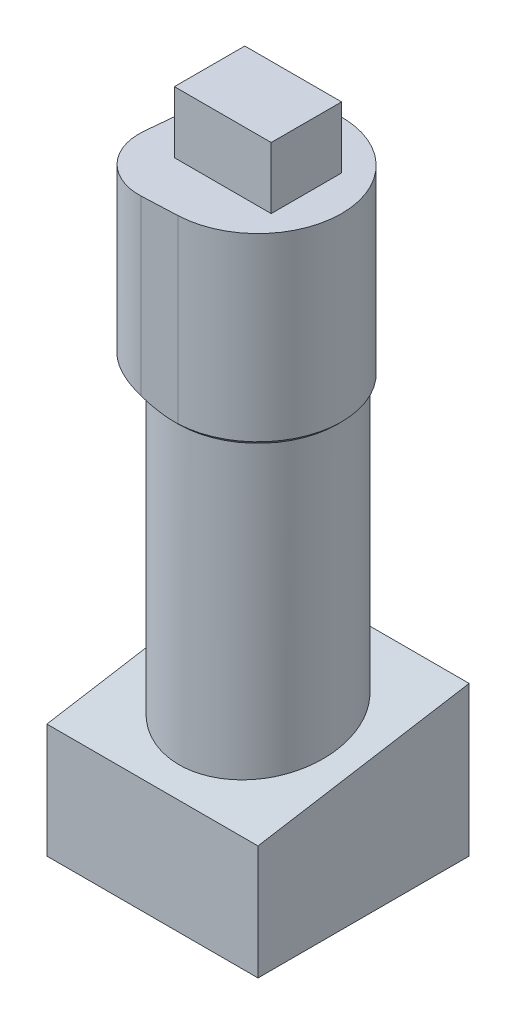
ISO-10303-21;
HEADER;
FILE_DESCRIPTION(('STEP AP214'),'2;1');
FILE_NAME('part.step','',(''),(''),'','','');
FILE_SCHEMA(('AUTOMOTIVE_DESIGN { 1 0 10303 214 1 1 1 1 }'));
ENDSEC;
DATA;
#1=APPLICATION_CONTEXT('core data for automotive mechanical design processes');
#2=APPLICATION_PROTOCOL_DEFINITION('international standard','automotive_design',2000,#1);
#3=PRODUCT_CONTEXT('',#1,'mechanical');
#4=PRODUCT('Part','Part','',(#3));
#5=PRODUCT_RELATED_PRODUCT_CATEGORY('part','',(#4));
#6=PRODUCT_DEFINITION_FORMATION('','',#4);
#7=PRODUCT_DEFINITION_CONTEXT('part definition',#1,'design');
#8=PRODUCT_DEFINITION('design','',#6,#7);
#9=PRODUCT_DEFINITION_SHAPE('','',#8);
#10=(LENGTH_UNIT() NAMED_UNIT(*) SI_UNIT(.MILLI.,.METRE.));
#11=(NAMED_UNIT(*) PLANE_ANGLE_UNIT() SI_UNIT($,.RADIAN.));
#12=(NAMED_UNIT(*) SI_UNIT($,.STERADIAN.) SOLID_ANGLE_UNIT());
#13=UNCERTAINTY_MEASURE_WITH_UNIT(LENGTH_MEASURE(1.E-05),#10,'distance_accuracy_value','');
#14=(GEOMETRIC_REPRESENTATION_CONTEXT(3) GLOBAL_UNCERTAINTY_ASSIGNED_CONTEXT((#13)) GLOBAL_UNIT_ASSIGNED_CONTEXT((#10,
#11,#12)) REPRESENTATION_CONTEXT('',''));
#15=CARTESIAN_POINT('',(0.,0.,0.));
#16=DIRECTION('',(0.,0.,1.));
#17=DIRECTION('',(1.,0.,0.));
#18=AXIS2_PLACEMENT_3D('',#15,#16,#17);
#19=CARTESIAN_POINT('',(12.,17.,12.));
#20=DIRECTION('',(-1.,0.,0.));
#21=DIRECTION('',(0.,0.,1.));
#22=AXIS2_PLACEMENT_3D('',#19,#20,#21);
#23=PLANE('',#22);
#24=DIRECTION('',(0.,-1.,0.));
#25=VECTOR('',#24,1.);
#26=CARTESIAN_POINT('',(12.,17.,-12.));
#27=LINE('',#26,#25);
#28=CARTESIAN_POINT('',(12.,17.,-12.));
#29=VERTEX_POINT('',#28);
#30=CARTESIAN_POINT('',(12.,0.,-12.));
#31=VERTEX_POINT('',#30);
#32=EDGE_CURVE('E203',#29,#31,#27,.T.);
#33=ORIENTED_EDGE('',*,*,#32,.F.);
#34=DIRECTION('',(0.,-0.164398987305357,0.986393923832144));
#35=VECTOR('',#34,1.);
#36=CARTESIAN_POINT('',(12.,17.,-12.));
#37=LINE('',#36,#35);
#38=CARTESIAN_POINT('',(12.,13.,12.));
#39=VERTEX_POINT('',#38);
#40=EDGE_CURVE('E175',#29,#39,#37,.T.);
#41=ORIENTED_EDGE('',*,*,#40,.T.);
#42=DIRECTION('',(0.,-1.,0.));
#43=VECTOR('',#42,1.);
#44=CARTESIAN_POINT('',(12.,17.,12.));
#45=LINE('',#44,#43);
#46=CARTESIAN_POINT('',(12.,0.,12.));
#47=VERTEX_POINT('',#46);
#48=EDGE_CURVE('E186',#39,#47,#45,.T.);
#49=ORIENTED_EDGE('',*,*,#48,.T.);
#50=DIRECTION('',(0.,0.,-1.));
#51=VECTOR('',#50,1.);
#52=CARTESIAN_POINT('',(12.,0.,12.));
#53=LINE('',#52,#51);
#54=EDGE_CURVE('E183',#47,#31,#53,.T.);
#55=ORIENTED_EDGE('',*,*,#54,.T.);
#56=EDGE_LOOP('',(#33,#41,#49,#55));
#57=FACE_BOUND('',#56,.T.);
#58=ADVANCED_FACE('F34',(#57),#23,.F.);
#59=CARTESIAN_POINT('',(-12.,17.,-12.));
#60=DIRECTION('',(0.,0.,1.));
#61=DIRECTION('',(1.,0.,0.));
#62=AXIS2_PLACEMENT_3D('',#59,#60,#61);
#63=PLANE('',#62);
#64=CARTESIAN_POINT('',(-5.,12.,-12.));
#65=DIRECTION('',(0.,0.,-1.));
#66=DIRECTION('',(-1.,0.,0.));
#67=AXIS2_PLACEMENT_3D('',#64,#65,#66);
#68=CIRCLE('',#67,2.05);
#69=CARTESIAN_POINT('',(-7.05,12.,-12.));
#70=VERTEX_POINT('',#69);
#71=EDGE_CURVE('E476',#70,#70,#68,.T.);
#72=ORIENTED_EDGE('',*,*,#71,.F.);
#73=EDGE_LOOP('',(#72));
#74=FACE_BOUND('',#73,.T.);
#75=CARTESIAN_POINT('',(5.,12.,-12.));
#76=DIRECTION('',(0.,0.,-1.));
#77=DIRECTION('',(-1.,0.,0.));
#78=AXIS2_PLACEMENT_3D('',#75,#76,#77);
#79=CIRCLE('',#78,2.05);
#80=CARTESIAN_POINT('',(2.95,12.,-12.));
#81=VERTEX_POINT('',#80);
#82=EDGE_CURVE('E479',#81,#81,#79,.T.);
#83=ORIENTED_EDGE('',*,*,#82,.F.);
#84=EDGE_LOOP('',(#83));
#85=FACE_BOUND('',#84,.T.);
#86=DIRECTION('',(-1.,0.,0.));
#87=VECTOR('',#86,1.);
#88=CARTESIAN_POINT('',(-12.,0.,-12.));
#89=LINE('',#88,#87);
#90=CARTESIAN_POINT('',(-12.,0.,-12.));
#91=VERTEX_POINT('',#90);
#92=EDGE_CURVE('E190',#31,#91,#89,.T.);
#93=ORIENTED_EDGE('',*,*,#92,.T.);
#94=DIRECTION('',(0.,-1.,0.));
#95=VECTOR('',#94,1.);
#96=CARTESIAN_POINT('',(-12.,17.,-12.));
#97=LINE('',#96,#95);
#98=CARTESIAN_POINT('',(-12.,17.,-12.));
#99=VERTEX_POINT('',#98);
#100=EDGE_CURVE('E200',#99,#91,#97,.T.);
#101=ORIENTED_EDGE('',*,*,#100,.F.);
#102=DIRECTION('',(-1.,0.,0.));
#103=VECTOR('',#102,1.);
#104=CARTESIAN_POINT('',(-12.,17.,-12.));
#105=LINE('',#104,#103);
#106=EDGE_CURVE('E184',#29,#99,#105,.T.);
#107=ORIENTED_EDGE('',*,*,#106,.F.);
#108=ORIENTED_EDGE('',*,*,#32,.T.);
#109=EDGE_LOOP('',(#93,#101,#107,#108));
#110=FACE_BOUND('',#109,.T.);
#111=ADVANCED_FACE('F288',(#74,#85,#110),#63,.F.);
#112=CARTESIAN_POINT('',(-12.,17.,12.));
#113=DIRECTION('',(1.,0.,0.));
#114=DIRECTION('',(0.,0.,-1.));
#115=AXIS2_PLACEMENT_3D('',#112,#113,#114);
#116=PLANE('',#115);
#117=DIRECTION('',(0.,-1.,0.));
#118=VECTOR('',#117,1.);
#119=CARTESIAN_POINT('',(-12.,17.,12.));
#120=LINE('',#119,#118);
#121=CARTESIAN_POINT('',(-12.,13.,12.));
#122=VERTEX_POINT('',#121);
#123=CARTESIAN_POINT('',(-12.,0.,12.));
#124=VERTEX_POINT('',#123);
#125=EDGE_CURVE('E198',#122,#124,#120,.T.);
#126=ORIENTED_EDGE('',*,*,#125,.F.);
#127=DIRECTION('',(0.,-0.164398987305357,0.986393923832144));
#128=VECTOR('',#127,1.);
#129=CARTESIAN_POINT('',(-12.,17.,-12.));
#130=LINE('',#129,#128);
#131=EDGE_CURVE('E179',#99,#122,#130,.T.);
#132=ORIENTED_EDGE('',*,*,#131,.F.);
#133=ORIENTED_EDGE('',*,*,#100,.T.);
#134=DIRECTION('',(0.,0.,1.));
#135=VECTOR('',#134,1.);
#136=CARTESIAN_POINT('',(-12.,0.,12.));
#137=LINE('',#136,#135);
#138=EDGE_CURVE('E192',#91,#124,#137,.T.);
#139=ORIENTED_EDGE('',*,*,#138,.T.);
#140=EDGE_LOOP('',(#126,#132,#133,#139));
#141=FACE_BOUND('',#140,.T.);
#142=ADVANCED_FACE('F293',(#141),#116,.F.);
#143=CARTESIAN_POINT('',(-12.,17.,12.));
#144=DIRECTION('',(0.,0.,-1.));
#145=DIRECTION('',(-1.,0.,0.));
#146=AXIS2_PLACEMENT_3D('',#143,#144,#145);
#147=PLANE('',#146);
#148=ORIENTED_EDGE('',*,*,#48,.F.);
#149=DIRECTION('',(-1.,0.,0.));
#150=VECTOR('',#149,1.);
#151=CARTESIAN_POINT('',(12.,13.,12.));
#152=LINE('',#151,#150);
#153=EDGE_CURVE('E178',#39,#122,#152,.T.);
#154=ORIENTED_EDGE('',*,*,#153,.T.);
#155=ORIENTED_EDGE('',*,*,#125,.T.);
#156=DIRECTION('',(1.,0.,0.));
#157=VECTOR('',#156,1.);
#158=CARTESIAN_POINT('',(-12.,0.,12.));
#159=LINE('',#158,#157);
#160=EDGE_CURVE('E187',#124,#47,#159,.T.);
#161=ORIENTED_EDGE('',*,*,#160,.T.);
#162=EDGE_LOOP('',(#148,#154,#155,#161));
#163=FACE_BOUND('',#162,.T.);
#164=ADVANCED_FACE('F300',(#163),#147,.F.);
#165=CARTESIAN_POINT('',(0.,0.,0.));
#166=DIRECTION('',(0.,-1.,0.));
#167=DIRECTION('',(0.,0.,-1.));
#168=AXIS2_PLACEMENT_3D('',#165,#166,#167);
#169=PLANE('',#168);
#170=ORIENTED_EDGE('',*,*,#54,.F.);
#171=ORIENTED_EDGE('',*,*,#160,.F.);
#172=ORIENTED_EDGE('',*,*,#138,.F.);
#173=ORIENTED_EDGE('',*,*,#92,.F.);
#174=EDGE_LOOP('',(#170,#171,#172,#173));
#175=FACE_BOUND('',#174,.T.);
#176=ADVANCED_FACE('F304',(#175),#169,.T.);
#177=CARTESIAN_POINT('',(12.,17.,-12.));
#178=DIRECTION('',(0.,-0.986393923832144,-0.164398987305357));
#179=DIRECTION('',(0.,0.164398987305357,-0.986393923832144));
#180=AXIS2_PLACEMENT_3D('',#177,#178,#179);
#181=PLANE('',#180);
#182=CARTESIAN_POINT('',(0.,15.,0.));
#183=DIRECTION('',(0.,-0.986393923832144,-0.164398987305357));
#184=DIRECTION('',(0.,-0.164398987305357,0.986393923832144));
#185=AXIS2_PLACEMENT_3D('',#182,#183,#184);
#186=ELLIPSE('',#185,9.12414379544733,9.);
#187=CARTESIAN_POINT('',(0.,13.5,9.));
#188=VERTEX_POINT('',#187);
#189=EDGE_CURVE('E174',#188,#188,#186,.T.);
#190=ORIENTED_EDGE('',*,*,#189,.T.);
#191=EDGE_LOOP('',(#190));
#192=FACE_BOUND('',#191,.T.);
#193=ORIENTED_EDGE('',*,*,#131,.T.);
#194=ORIENTED_EDGE('',*,*,#153,.F.);
#195=ORIENTED_EDGE('',*,*,#40,.F.);
#196=ORIENTED_EDGE('',*,*,#106,.T.);
#197=EDGE_LOOP('',(#193,#194,#195,#196));
#198=FACE_BOUND('',#197,.T.);
#199=ADVANCED_FACE('F307',(#192,#198),#181,.F.);
#200=CARTESIAN_POINT('',(0.,52.,0.));
#201=DIRECTION('',(0.,-1.,0.));
#202=DIRECTION('',(0.,0.,-1.));
#203=AXIS2_PLACEMENT_3D('',#200,#201,#202);
#204=CYLINDRICAL_SURFACE('',#203,9.);
#205=CARTESIAN_POINT('',(0.,46.9999999999999,0.));
#206=DIRECTION('',(0.,1.,0.));
#207=DIRECTION('',(0.,0.,1.));
#208=AXIS2_PLACEMENT_3D('',#205,#206,#207);
#209=CIRCLE('',#208,9.);
#210=CARTESIAN_POINT('',(0.,46.9999999999999,9.));
#211=VERTEX_POINT('',#210);
#212=EDGE_CURVE('E206',#211,#211,#209,.F.);
#213=ORIENTED_EDGE('',*,*,#212,.T.);
#214=EDGE_LOOP('',(#213));
#215=FACE_BOUND('',#214,.T.);
#216=ORIENTED_EDGE('',*,*,#189,.F.);
#217=EDGE_LOOP('',(#216));
#218=FACE_BOUND('',#217,.T.);
#219=ADVANCED_FACE('F233',(#215,#218),#204,.T.);
#220=CARTESIAN_POINT('',(-3.86826162983517,68.,3.6707021280932));
#221=DIRECTION('',(0.,-1.,0.));
#222=DIRECTION('',(0.,0.,-1.));
#223=AXIS2_PLACEMENT_3D('',#220,#221,#222);
#224=CYLINDRICAL_SURFACE('',#223,6.);
#225=DIRECTION('',(0.,-1.,0.));
#226=VECTOR('',#225,1.);
#227=CARTESIAN_POINT('',(-9.84083401998827,68.,3.09765846101286));
#228=LINE('',#227,#226);
#229=CARTESIAN_POINT('',(-9.84083401998827,68.,3.09765846101286));
#230=VERTEX_POINT('',#229);
#231=CARTESIAN_POINT('',(-9.84083401998827,48.3168552451821,3.09765846101286));
#232=VERTEX_POINT('',#231);
#233=EDGE_CURVE('E166',#230,#232,#228,.T.);
#234=ORIENTED_EDGE('',*,*,#233,.T.);
#235=CARTESIAN_POINT('',(-9.84083401998827,48.3168552451821,3.09765846101286));
#236=CARTESIAN_POINT('',(-9.85573754474704,48.3776440578477,3.25280616041078));
#237=CARTESIAN_POINT('',(-9.86464730566725,48.436178111364,3.40944212347759));
#238=CARTESIAN_POINT('',(-9.87008583844924,48.5484736473786,3.72469532544573));
#239=CARTESIAN_POINT('',(-9.86660958426917,48.602233183385,3.88331334261025));
#240=CARTESIAN_POINT('',(-9.84684585274468,48.7047915414958,4.20179503951704));
#241=CARTESIAN_POINT('',(-9.83052720027604,48.7535779653433,4.36166081198082));
#242=CARTESIAN_POINT('',(-9.78478105392862,48.8457521005011,4.68105677672731));
#243=CARTESIAN_POINT('',(-9.75535535342605,48.8891405493524,4.84058701192074));
#244=CARTESIAN_POINT('',(-9.68315170878094,48.9703749443236,5.15855600198107));
#245=CARTESIAN_POINT('',(-9.64033526306552,49.0082044401845,5.316990245692));
#246=CARTESIAN_POINT('',(-9.54138953614979,49.0779167848524,5.63098602827183));
#247=CARTESIAN_POINT('',(-9.48526073070653,49.1097998461002,5.78654766958768));
#248=CARTESIAN_POINT('',(-9.35994992038933,49.1673563288671,6.09325547745622));
#249=CARTESIAN_POINT('',(-9.29078600899688,49.1930382465376,6.24440743301604));
#250=CARTESIAN_POINT('',(-9.13970284784554,49.2380583275038,6.54117718453411));
#251=CARTESIAN_POINT('',(-9.05778445896232,49.257396918675,6.68679535317595));
#252=CARTESIAN_POINT('',(-8.88660149788428,49.2886913296795,6.96330327803644));
#253=CARTESIAN_POINT('',(-8.79799611022533,49.3009970522908,7.09456199528907));
#254=CARTESIAN_POINT('',(-8.61045793769266,49.3197327494017,7.34992291844453));
#255=CARTESIAN_POINT('',(-8.51152563141967,49.3261629960655,7.47402545558686));
#256=CARTESIAN_POINT('',(-8.30402165749475,49.3331032112673,7.71411842149772));
#257=CARTESIAN_POINT('',(-8.19544778514609,49.3336118221987,7.83010698398133));
#258=CARTESIAN_POINT('',(-7.96951204101418,49.328701571032,8.05304516386679));
#259=CARTESIAN_POINT('',(-7.85215032577429,49.3232828144985,8.15999494220997));
#260=CARTESIAN_POINT('',(-7.61396763812992,49.3068601938132,8.3603743115635));
#261=CARTESIAN_POINT('',(-7.4934257036712,49.2960656201865,8.45415319047075));
#262=CARTESIAN_POINT('',(-7.2459116939912,49.2690736094618,8.63202372343476));
#263=CARTESIAN_POINT('',(-7.1189376187236,49.252874482986,8.71611233739647));
#264=CARTESIAN_POINT('',(-6.85958715346042,49.2151830505001,8.87406829058441));
#265=CARTESIAN_POINT('',(-6.72721223781714,49.1936921811003,8.94793839546024));
#266=CARTESIAN_POINT('',(-6.45800864431225,49.145547420143,9.08513056829842));
#267=CARTESIAN_POINT('',(-6.3211797820613,49.1188933146056,9.14845219889794));
#268=CARTESIAN_POINT('',(-6.04184509332307,49.060112967494,9.26523676308325));
#269=CARTESIAN_POINT('',(-5.89928340639167,49.0279057907856,9.31852522098738));
#270=CARTESIAN_POINT('',(-5.61167542340985,48.9585240061154,9.41382439227958));
#271=CARTESIAN_POINT('',(-5.4666298308898,48.9213507850716,9.45583824462063));
#272=CARTESIAN_POINT('',(-5.17503464619293,48.8422375693034,9.52859630935772));
#273=CARTESIAN_POINT('',(-5.02848512105144,48.8002977862085,9.55934102183362));
#274=CARTESIAN_POINT('',(-4.73488931269597,48.7118802410956,9.609652774014));
#275=CARTESIAN_POINT('',(-4.58784318401978,48.665403784124,9.62922301720097));
#276=CARTESIAN_POINT('',(-4.30128424339746,48.5704953156699,9.65670113890683));
#277=CARTESIAN_POINT('',(-4.16175274768609,48.5222682329774,9.66512975503689));
#278=CARTESIAN_POINT('',(-3.88411968640995,48.4222233886129,9.67228646588472));
#279=CARTESIAN_POINT('',(-3.74601543750733,48.3704148040016,9.67103850441741));
#280=CARTESIAN_POINT('',(-3.60881367641573,48.3168552451821,9.6650900667794));
#281=B_SPLINE_CURVE_WITH_KNOTS('',3,(#235,#236,#237,#238,#239,#240,#241,#242,#243,#244,#245,
#246,#247,#248,#249,#250,#251,#252,#253,#254,#255,#256,#257,#258,#259,#260,#261,#262,#263,#264,
#265,#266,#267,#268,#269,#270,#271,#272,#273,#274,#275,#276,#277,#278,#279,#280),.UNSPECIFIED.,
.F.,.F.,(4,2,2,2,2,2,2,2,2,2,2,2,2,2,2,2,2,2,2,2,2,2,4),(0.,0.501802618237004,1.00380888293515,
1.50703754886879,2.0101973815125,2.51481742878223,3.01941944466,3.52332613460137,
4.02719882761027,4.50313288390196,4.97904489282873,5.45506600818417,5.93107864589307,
6.38985893536135,6.84878276686603,7.30758214614069,7.76640054350992,8.23258034401857,
8.69863022085125,9.16465941372922,9.63055493879385,10.0737997870465,10.5159482167062),.UNSPECIFIED.);
#282=CARTESIAN_POINT('',(-3.60881367641573,48.3168552451821,9.6650900667794));
#283=VERTEX_POINT('',#282);
#284=EDGE_CURVE('E49',#232,#283,#281,.T.);
#285=ORIENTED_EDGE('',*,*,#284,.T.);
#286=DIRECTION('',(0.,-1.,0.));
#287=VECTOR('',#286,1.);
#288=CARTESIAN_POINT('',(-3.60881367641573,68.,9.6650900667794));
#289=LINE('',#288,#287);
#290=CARTESIAN_POINT('',(-3.60881367641573,68.,9.6650900667794));
#291=VERTEX_POINT('',#290);
#292=EDGE_CURVE('E172',#291,#283,#289,.T.);
#293=ORIENTED_EDGE('',*,*,#292,.F.);
#294=CARTESIAN_POINT('',(-3.86826162983517,68.,3.6707021280932));
#295=DIRECTION('',(0.,1.,0.));
#296=DIRECTION('',(0.,0.,1.));
#297=AXIS2_PLACEMENT_3D('',#294,#295,#296);
#298=CIRCLE('',#297,6.);
#299=EDGE_CURVE('E152',#230,#291,#298,.T.);
#300=ORIENTED_EDGE('',*,*,#299,.F.);
#301=EDGE_LOOP('',(#234,#285,#293,#300));
#302=FACE_BOUND('',#301,.T.);
#303=ADVANCED_FACE('F226',(#302),#224,.T.);
#304=CARTESIAN_POINT('',(-3.60881367641573,68.,9.6650900667794));
#305=DIRECTION('',(-0.0432413255699056,0.,-0.999064656447698));
#306=DIRECTION('',(-0.999064656447698,0.,0.0432413255699056));
#307=AXIS2_PLACEMENT_3D('',#304,#305,#306);
#308=PLANE('',#307);
#309=ORIENTED_EDGE('',*,*,#292,.T.);
#310=CARTESIAN_POINT('',(-3.60881367641573,48.3168552451821,9.6650900667794));
#311=CARTESIAN_POINT('',(-3.4485766210115,48.2543090111599,9.65815471716375));
#312=CARTESIAN_POINT('',(-3.28724732144487,48.1945047615118,9.65117209324496));
#313=CARTESIAN_POINT('',(-2.96273052913715,48.0811131728394,9.63712641944546));
#314=CARTESIAN_POINT('',(-2.79954661410567,48.0275155566698,9.63006352441448));
#315=CARTESIAN_POINT('',(-2.47108014378419,47.9270471933909,9.61584690140585));
#316=CARTESIAN_POINT('',(-2.30579723665992,47.8801775906767,9.60869315820017));
#317=CARTESIAN_POINT('',(-1.97304371465778,47.7937411755076,9.59429098383981));
#318=CARTESIAN_POINT('',(-1.80556988585717,47.7541867871958,9.58704241358075));
#319=CARTESIAN_POINT('',(-1.63722106527422,47.7186530600417,9.57975597209455));
#320=B_SPLINE_CURVE_WITH_KNOTS('',3,(#310,#311,#312,#313,#314,#315,#316,#317,#318,#319),
.UNSPECIFIED.,.F.,.F.,(4,2,2,2,4),(0.,0.516460874359341,1.03205396335808,1.54773464802627,
2.06428327785127),.UNSPECIFIED.);
#321=CARTESIAN_POINT('',(-1.63722106527422,47.7186530600417,9.57975597209455));
#322=VERTEX_POINT('',#321);
#323=EDGE_CURVE('E11',#283,#322,#320,.T.);
#324=ORIENTED_EDGE('',*,*,#323,.T.);
#325=CARTESIAN_POINT('',(-1.63722106527422,47.7186530600417,9.57975597209455));
#326=CARTESIAN_POINT('',(-1.46877277749134,47.6830686239895,9.57246522548801));
#327=CARTESIAN_POINT('',(-1.29944824053798,47.6515330946803,9.56513655323229));
#328=CARTESIAN_POINT('',(-0.959894777084272,47.5971006116259,9.55044006510529));
#329=CARTESIAN_POINT('',(-0.789669563811105,47.5741803916843,9.54307240994919));
#330=CARTESIAN_POINT('',(-0.448223675051389,47.5373186850589,9.52829401423168));
#331=CARTESIAN_POINT('',(-0.277002893562176,47.5233781728276,9.52088326908228));
#332=CARTESIAN_POINT('',(0.0664052877205288,47.5046904651637,9.50601994179472));
#333=CARTESIAN_POINT('',(0.238594050205988,47.4999684470195,9.49856730067679));
#334=CARTESIAN_POINT('',(0.410792592914101,47.4999999999999,9.49111423625313));
#335=B_SPLINE_CURVE_WITH_KNOTS('',3,(#325,#326,#327,#328,#329,#330,#331,#332,#333,#334),
.UNSPECIFIED.,.F.,.F.,(4,2,2,2,4),(0.,0.516943582172929,1.03248092008697,1.54807419323473,
2.06507368083808),.UNSPECIFIED.);
#336=CARTESIAN_POINT('',(0.4107925929141,47.4999999999999,9.49111423625313));
#337=VERTEX_POINT('',#336);
#338=EDGE_CURVE('E211',#322,#337,#335,.T.);
#339=ORIENTED_EDGE('',*,*,#338,.T.);
#340=DIRECTION('',(0.,-1.,0.));
#341=VECTOR('',#340,1.);
#342=CARTESIAN_POINT('',(0.4107925929141,68.,9.49111423625313));
#343=LINE('',#342,#341);
#344=CARTESIAN_POINT('',(0.4107925929141,68.,9.49111423625313));
#345=VERTEX_POINT('',#344);
#346=EDGE_CURVE('E170',#345,#337,#343,.T.);
#347=ORIENTED_EDGE('',*,*,#346,.F.);
#348=DIRECTION('',(0.999064656447698,0.,-0.0432413255699056));
#349=VECTOR('',#348,1.);
#350=CARTESIAN_POINT('',(-3.60881367641573,68.,9.6650900667794));
#351=LINE('',#350,#349);
#352=EDGE_CURVE('E155',#291,#345,#351,.T.);
#353=ORIENTED_EDGE('',*,*,#352,.F.);
#354=EDGE_LOOP('',(#309,#324,#339,#347,#353));
#355=FACE_BOUND('',#354,.T.);
#356=ADVANCED_FACE('F220',(#355),#308,.F.);
#357=CARTESIAN_POINT('',(0.,68.,0.));
#358=DIRECTION('',(0.,-1.,0.));
#359=DIRECTION('',(0.,0.,-1.));
#360=AXIS2_PLACEMENT_3D('',#357,#358,#359);
#361=CYLINDRICAL_SURFACE('',#360,9.5);
#362=ORIENTED_EDGE('',*,*,#346,.T.);
#363=CARTESIAN_POINT('',(0.,47.4999999999999,0.));
#364=DIRECTION('',(0.,1.,0.));
#365=DIRECTION('',(0.,0.,1.));
#366=AXIS2_PLACEMENT_3D('',#363,#364,#365);
#367=CIRCLE('',#366,9.5);
#368=CARTESIAN_POINT('',(-9.45657295107574,47.4999999999999,-0.907319139543884));
#369=VERTEX_POINT('',#368);
#370=EDGE_CURVE('E218',#337,#369,#367,.T.);
#371=ORIENTED_EDGE('',*,*,#370,.T.);
#372=DIRECTION('',(0.,-1.,0.));
#373=VECTOR('',#372,1.);
#374=CARTESIAN_POINT('',(-9.45657295107574,68.,-0.907319139543884));
#375=LINE('',#374,#373);
#376=CARTESIAN_POINT('',(-9.45657295107574,68.,-0.907319139543884));
#377=VERTEX_POINT('',#376);
#378=EDGE_CURVE('E168',#377,#369,#375,.T.);
#379=ORIENTED_EDGE('',*,*,#378,.F.);
#380=CARTESIAN_POINT('',(0.,68.,0.));
#381=DIRECTION('',(0.,1.,0.));
#382=DIRECTION('',(0.,0.,1.));
#383=AXIS2_PLACEMENT_3D('',#380,#381,#382);
#384=CIRCLE('',#383,9.5);
#385=EDGE_CURVE('E162',#345,#377,#384,.T.);
#386=ORIENTED_EDGE('',*,*,#385,.F.);
#387=EDGE_LOOP('',(#362,#371,#379,#386));
#388=FACE_BOUND('',#387,.T.);
#389=ADVANCED_FACE('F225',(#388),#361,.T.);
#390=CARTESIAN_POINT('',(-9.45657295107574,68.,-0.907319139543884));
#391=DIRECTION('',(0.995428731692183,0.,0.0955072778467242));
#392=DIRECTION('',(0.0955072778467242,0.,-0.995428731692183));
#393=AXIS2_PLACEMENT_3D('',#390,#391,#392);
#394=PLANE('',#393);
#395=ORIENTED_EDGE('',*,*,#378,.T.);
#396=CARTESIAN_POINT('',(-9.45657295107574,47.4999999999999,-0.907319139543884));
#397=CARTESIAN_POINT('',(-9.47048770563757,47.4999831475193,-0.762292008653158));
#398=CARTESIAN_POINT('',(-9.48440191357004,47.5033511023661,-0.617270575030638));
#399=CARTESIAN_POINT('',(-9.51219908493016,47.5167314875751,-0.327553354987602));
#400=CARTESIAN_POINT('',(-9.52608205284939,47.5267428921619,-0.182857521753334));
#401=CARTESIAN_POINT('',(-9.55377139618719,47.5532664206997,0.105735856066162));
#402=CARTESIAN_POINT('',(-9.56757785193361,47.569769370379,0.249634237872025));
#403=CARTESIAN_POINT('',(-9.59510867305702,47.6090387382205,0.536575411059955));
#404=CARTESIAN_POINT('',(-9.60883303632164,47.6318053168542,0.679618180425662));
#405=CARTESIAN_POINT('',(-9.64950258619469,47.7084184954215,1.10349832193274));
#406=CARTESIAN_POINT('',(-9.6763017829475,47.7709358872637,1.38281410849334));
#407=CARTESIAN_POINT('',(-9.72937848972814,47.9164968943924,1.93600837917332));
#408=CARTESIAN_POINT('',(-9.75565600038717,47.999540484842,2.20988686987143));
#409=CARTESIAN_POINT('',(-9.7915814781609,48.1264105327673,2.58432171485919));
#410=CARTESIAN_POINT('',(-9.80147551274591,48.1627769350919,2.68744271799448));
#411=CARTESIAN_POINT('',(-9.82120497822794,48.2380013740438,2.89307392479385));
#412=CARTESIAN_POINT('',(-9.8310401998457,48.2768654323746,2.99558194723573));
#413=CARTESIAN_POINT('',(-9.84083401998827,48.3168552451821,3.09765846101286));
#414=B_SPLINE_CURVE_WITH_KNOTS('',3,(#396,#397,#398,#399,#400,#401,#402,#403,#404,#405,#406,
#407,#408,#409,#410,#411,#412,#413),.UNSPECIFIED.,.F.,.F.,(4,2,2,2,2,2,2,2,4),(0.,
0.437030996981679,0.873994530315787,1.31034272451418,1.74670209880244,2.60817550314992,
3.46964786511195,3.79900338882883,4.12918514039466),.UNSPECIFIED.);
#415=EDGE_CURVE('E241',#369,#232,#414,.T.);
#416=ORIENTED_EDGE('',*,*,#415,.T.);
#417=ORIENTED_EDGE('',*,*,#233,.F.);
#418=DIRECTION('',(-0.0955072778467242,0.,0.995428731692183));
#419=VECTOR('',#418,1.);
#420=CARTESIAN_POINT('',(-9.45657295107574,68.,-0.907319139543884));
#421=LINE('',#420,#419);
#422=EDGE_CURVE('E164',#377,#230,#421,.T.);
#423=ORIENTED_EDGE('',*,*,#422,.F.);
#424=EDGE_LOOP('',(#395,#416,#417,#423));
#425=FACE_BOUND('',#424,.T.);
#426=ADVANCED_FACE('F247',(#425),#394,.F.);
#427=CARTESIAN_POINT('',(-3.86826162983517,68.,3.6707021280932));
#428=DIRECTION('',(0.,1.,0.));
#429=DIRECTION('',(0.,0.,1.));
#430=AXIS2_PLACEMENT_3D('',#427,#428,#429);
#431=PLANE('',#430);
#432=DIRECTION('',(0.,0.,-1.));
#433=VECTOR('',#432,1.);
#434=CARTESIAN_POINT('',(5.5,68.,4.));
#435=LINE('',#434,#433);
#436=CARTESIAN_POINT('',(5.5,68.,4.));
#437=VERTEX_POINT('',#436);
#438=CARTESIAN_POINT('',(5.5,68.,-4.));
#439=VERTEX_POINT('',#438);
#440=EDGE_CURVE('E56',#437,#439,#435,.T.);
#441=ORIENTED_EDGE('',*,*,#440,.F.);
#442=DIRECTION('',(1.,0.,0.));
#443=VECTOR('',#442,1.);
#444=CARTESIAN_POINT('',(-5.5,68.,4.));
#445=LINE('',#444,#443);
#446=CARTESIAN_POINT('',(-5.5,68.,4.));
#447=VERTEX_POINT('',#446);
#448=EDGE_CURVE('E60',#447,#437,#445,.T.);
#449=ORIENTED_EDGE('',*,*,#448,.F.);
#450=DIRECTION('',(0.,0.,1.));
#451=VECTOR('',#450,1.);
#452=CARTESIAN_POINT('',(-5.5,68.,4.));
#453=LINE('',#452,#451);
#454=CARTESIAN_POINT('',(-5.5,68.,-4.));
#455=VERTEX_POINT('',#454);
#456=EDGE_CURVE('E494',#455,#447,#453,.T.);
#457=ORIENTED_EDGE('',*,*,#456,.F.);
#458=DIRECTION('',(-1.,0.,0.));
#459=VECTOR('',#458,1.);
#460=CARTESIAN_POINT('',(-5.5,68.,-4.));
#461=LINE('',#460,#459);
#462=EDGE_CURVE('E491',#439,#455,#461,.T.);
#463=ORIENTED_EDGE('',*,*,#462,.F.);
#464=EDGE_LOOP('',(#441,#449,#457,#463));
#465=FACE_BOUND('',#464,.T.);
#466=ORIENTED_EDGE('',*,*,#299,.T.);
#467=ORIENTED_EDGE('',*,*,#352,.T.);
#468=ORIENTED_EDGE('',*,*,#385,.T.);
#469=ORIENTED_EDGE('',*,*,#422,.T.);
#470=EDGE_LOOP('',(#466,#467,#468,#469));
#471=FACE_BOUND('',#470,.T.);
#472=ADVANCED_FACE('F251',(#465,#471),#431,.T.);
#473=CARTESIAN_POINT('',(0.,46.9999999999999,0.));
#474=DIRECTION('',(0.,1.,0.));
#475=DIRECTION('',(0.,0.,1.));
#476=AXIS2_PLACEMENT_3D('',#473,#474,#475);
#477=CONICAL_SURFACE('',#476,9.,0.785398163397443);
#478=ORIENTED_EDGE('',*,*,#370,.F.);
#479=ORIENTED_EDGE('',*,*,#338,.F.);
#480=ORIENTED_EDGE('',*,*,#323,.F.);
#481=ORIENTED_EDGE('',*,*,#284,.F.);
#482=ORIENTED_EDGE('',*,*,#415,.F.);
#483=EDGE_LOOP('',(#478,#479,#480,#481,#482));
#484=FACE_BOUND('',#483,.T.);
#485=ORIENTED_EDGE('',*,*,#212,.F.);
#486=EDGE_LOOP('',(#485));
#487=FACE_BOUND('',#486,.T.);
#488=ADVANCED_FACE('F37',(#484,#487),#477,.T.);
#489=CARTESIAN_POINT('',(5.5,75.,4.));
#490=DIRECTION('',(-1.,0.,0.));
#491=DIRECTION('',(0.,0.,1.));
#492=AXIS2_PLACEMENT_3D('',#489,#490,#491);
#493=PLANE('',#492);
#494=ORIENTED_EDGE('',*,*,#440,.T.);
#495=DIRECTION('',(0.,-1.,0.));
#496=VECTOR('',#495,1.);
#497=CARTESIAN_POINT('',(5.5,75.,-4.));
#498=LINE('',#497,#496);
#499=CARTESIAN_POINT('',(5.5,75.,-4.));
#500=VERTEX_POINT('',#499);
#501=EDGE_CURVE('E135',#500,#439,#498,.T.);
#502=ORIENTED_EDGE('',*,*,#501,.F.);
#503=DIRECTION('',(0.,0.,-1.));
#504=VECTOR('',#503,1.);
#505=CARTESIAN_POINT('',(5.5,75.,4.));
#506=LINE('',#505,#504);
#507=CARTESIAN_POINT('',(5.5,75.,4.));
#508=VERTEX_POINT('',#507);
#509=EDGE_CURVE('E141',#508,#500,#506,.T.);
#510=ORIENTED_EDGE('',*,*,#509,.F.);
#511=DIRECTION('',(0.,-1.,0.));
#512=VECTOR('',#511,1.);
#513=CARTESIAN_POINT('',(5.5,75.,4.));
#514=LINE('',#513,#512);
#515=EDGE_CURVE('E489',#508,#437,#514,.T.);
#516=ORIENTED_EDGE('',*,*,#515,.T.);
#517=EDGE_LOOP('',(#494,#502,#510,#516));
#518=FACE_BOUND('',#517,.T.);
#519=ADVANCED_FACE('F151',(#518),#493,.F.);
#520=CARTESIAN_POINT('',(-5.5,75.,-4.));
#521=DIRECTION('',(0.,0.,1.));
#522=DIRECTION('',(1.,0.,0.));
#523=AXIS2_PLACEMENT_3D('',#520,#521,#522);
#524=PLANE('',#523);
#525=ORIENTED_EDGE('',*,*,#462,.T.);
#526=DIRECTION('',(0.,-1.,0.));
#527=VECTOR('',#526,1.);
#528=CARTESIAN_POINT('',(-5.5,75.,-4.));
#529=LINE('',#528,#527);
#530=CARTESIAN_POINT('',(-5.5,75.,-4.));
#531=VERTEX_POINT('',#530);
#532=EDGE_CURVE('E137',#531,#455,#529,.T.);
#533=ORIENTED_EDGE('',*,*,#532,.F.);
#534=DIRECTION('',(-1.,0.,0.));
#535=VECTOR('',#534,1.);
#536=CARTESIAN_POINT('',(-5.5,75.,-4.));
#537=LINE('',#536,#535);
#538=EDGE_CURVE('E130',#500,#531,#537,.T.);
#539=ORIENTED_EDGE('',*,*,#538,.F.);
#540=ORIENTED_EDGE('',*,*,#501,.T.);
#541=EDGE_LOOP('',(#525,#533,#539,#540));
#542=FACE_BOUND('',#541,.T.);
#543=ADVANCED_FACE('F133',(#542),#524,.F.);
#544=CARTESIAN_POINT('',(-5.5,75.,4.));
#545=DIRECTION('',(1.,0.,0.));
#546=DIRECTION('',(0.,0.,-1.));
#547=AXIS2_PLACEMENT_3D('',#544,#545,#546);
#548=PLANE('',#547);
#549=ORIENTED_EDGE('',*,*,#456,.T.);
#550=DIRECTION('',(0.,-1.,0.));
#551=VECTOR('',#550,1.);
#552=CARTESIAN_POINT('',(-5.5,75.,4.));
#553=LINE('',#552,#551);
#554=CARTESIAN_POINT('',(-5.5,75.,4.));
#555=VERTEX_POINT('',#554);
#556=EDGE_CURVE('E157',#555,#447,#553,.T.);
#557=ORIENTED_EDGE('',*,*,#556,.F.);
#558=DIRECTION('',(0.,0.,1.));
#559=VECTOR('',#558,1.);
#560=CARTESIAN_POINT('',(-5.5,75.,4.));
#561=LINE('',#560,#559);
#562=EDGE_CURVE('E140',#531,#555,#561,.T.);
#563=ORIENTED_EDGE('',*,*,#562,.F.);
#564=ORIENTED_EDGE('',*,*,#532,.T.);
#565=EDGE_LOOP('',(#549,#557,#563,#564));
#566=FACE_BOUND('',#565,.T.);
#567=ADVANCED_FACE('F259',(#566),#548,.F.);
#568=CARTESIAN_POINT('',(-5.5,75.,4.));
#569=DIRECTION('',(0.,0.,-1.));
#570=DIRECTION('',(-1.,0.,0.));
#571=AXIS2_PLACEMENT_3D('',#568,#569,#570);
#572=PLANE('',#571);
#573=ORIENTED_EDGE('',*,*,#448,.T.);
#574=ORIENTED_EDGE('',*,*,#515,.F.);
#575=DIRECTION('',(1.,0.,0.));
#576=VECTOR('',#575,1.);
#577=CARTESIAN_POINT('',(-5.5,75.,4.));
#578=LINE('',#577,#576);
#579=EDGE_CURVE('E146',#555,#508,#578,.T.);
#580=ORIENTED_EDGE('',*,*,#579,.F.);
#581=ORIENTED_EDGE('',*,*,#556,.T.);
#582=EDGE_LOOP('',(#573,#574,#580,#581));
#583=FACE_BOUND('',#582,.T.);
#584=ADVANCED_FACE('F262',(#583),#572,.F.);
#585=CARTESIAN_POINT('',(0.,75.,0.));
#586=DIRECTION('',(0.,-1.,0.));
#587=DIRECTION('',(0.,0.,-1.));
#588=AXIS2_PLACEMENT_3D('',#585,#586,#587);
#589=PLANE('',#588);
#590=ORIENTED_EDGE('',*,*,#509,.T.);
#591=ORIENTED_EDGE('',*,*,#538,.T.);
#592=ORIENTED_EDGE('',*,*,#562,.T.);
#593=ORIENTED_EDGE('',*,*,#579,.T.);
#594=EDGE_LOOP('',(#590,#591,#592,#593));
#595=FACE_BOUND('',#594,.T.);
#596=ADVANCED_FACE('F144',(#595),#589,.F.);
#597=CARTESIAN_POINT('',(5.,12.,-6.));
#598=DIRECTION('',(0.,0.,-1.));
#599=DIRECTION('',(-1.,0.,0.));
#600=AXIS2_PLACEMENT_3D('',#597,#598,#599);
#601=CYLINDRICAL_SURFACE('',#600,2.05);
#602=CARTESIAN_POINT('',(5.,12.,-6.));
#603=DIRECTION('',(0.,0.,-1.));
#604=DIRECTION('',(-1.,0.,0.));
#605=AXIS2_PLACEMENT_3D('',#602,#603,#604);
#606=CIRCLE('',#605,2.05);
#607=CARTESIAN_POINT('',(2.95,12.,-6.));
#608=VERTEX_POINT('',#607);
#609=EDGE_CURVE('E481',#608,#608,#606,.T.);
#610=ORIENTED_EDGE('',*,*,#609,.F.);
#611=EDGE_LOOP('',(#610));
#612=FACE_BOUND('',#611,.T.);
#613=ORIENTED_EDGE('',*,*,#82,.T.);
#614=EDGE_LOOP('',(#613));
#615=FACE_BOUND('',#614,.T.);
#616=ADVANCED_FACE('F269',(#612,#615),#601,.F.);
#617=CARTESIAN_POINT('',(5.,12.,-6.));
#618=DIRECTION('',(0.,0.,-1.));
#619=DIRECTION('',(-1.,0.,0.));
#620=AXIS2_PLACEMENT_3D('',#617,#618,#619);
#621=PLANE('',#620);
#622=ORIENTED_EDGE('',*,*,#609,.T.);
#623=EDGE_LOOP('',(#622));
#624=FACE_BOUND('',#623,.T.);
#625=ADVANCED_FACE('F272',(#624),#621,.T.);
#626=CARTESIAN_POINT('',(-5.,12.,-6.));
#627=DIRECTION('',(0.,0.,-1.));
#628=DIRECTION('',(-1.,0.,0.));
#629=AXIS2_PLACEMENT_3D('',#626,#627,#628);
#630=CYLINDRICAL_SURFACE('',#629,2.05);
#631=CARTESIAN_POINT('',(-5.,12.,-6.));
#632=DIRECTION('',(0.,0.,-1.));
#633=DIRECTION('',(-1.,0.,0.));
#634=AXIS2_PLACEMENT_3D('',#631,#632,#633);
#635=CIRCLE('',#634,2.05);
#636=CARTESIAN_POINT('',(-7.05,12.,-6.));
#637=VERTEX_POINT('',#636);
#638=EDGE_CURVE('E492',#637,#637,#635,.T.);
#639=ORIENTED_EDGE('',*,*,#638,.F.);
#640=EDGE_LOOP('',(#639));
#641=FACE_BOUND('',#640,.T.);
#642=ORIENTED_EDGE('',*,*,#71,.T.);
#643=EDGE_LOOP('',(#642));
#644=FACE_BOUND('',#643,.T.);
#645=ADVANCED_FACE('F276',(#641,#644),#630,.F.);
#646=CARTESIAN_POINT('',(-5.,12.,-6.));
#647=DIRECTION('',(0.,0.,-1.));
#648=DIRECTION('',(-1.,0.,0.));
#649=AXIS2_PLACEMENT_3D('',#646,#647,#648);
#650=PLANE('',#649);
#651=ORIENTED_EDGE('',*,*,#638,.T.);
#652=EDGE_LOOP('',(#651));
#653=FACE_BOUND('',#652,.T.);
#654=ADVANCED_FACE('F280',(#653),#650,.T.);
#655=CLOSED_SHELL('',(#58,#111,#142,#164,#176,#199,#219,#303,#356,#389,#426,#472,#488,#519,#543,
#567,#584,#596,#616,#625,#645,#654));
#656=MANIFOLD_SOLID_BREP('B2',#655);
#657=ADVANCED_BREP_SHAPE_REPRESENTATION('',(#18,#656),#14);
#658=SHAPE_DEFINITION_REPRESENTATION(#9,#657);
ENDSEC;
END-ISO-10303-21;
